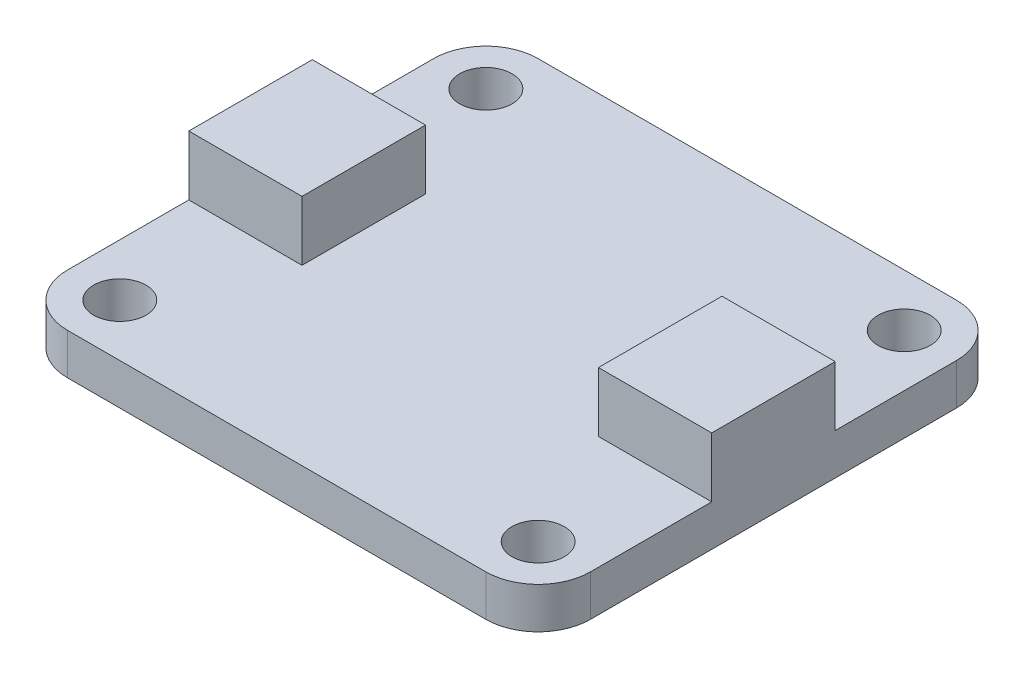
ISO-10303-21;
HEADER;
FILE_DESCRIPTION(('STEP AP214'),'2;1');
FILE_NAME('part.step','',(''),(''),'','','');
FILE_SCHEMA(('AUTOMOTIVE_DESIGN { 1 0 10303 214 1 1 1 1 }'));
ENDSEC;
DATA;
#1=APPLICATION_CONTEXT('core data for automotive mechanical design processes');
#2=APPLICATION_PROTOCOL_DEFINITION('international standard','automotive_design',2000,#1);
#3=PRODUCT_CONTEXT('',#1,'mechanical');
#4=PRODUCT('Part','Part','',(#3));
#5=PRODUCT_RELATED_PRODUCT_CATEGORY('part','',(#4));
#6=PRODUCT_DEFINITION_FORMATION('','',#4);
#7=PRODUCT_DEFINITION_CONTEXT('part definition',#1,'design');
#8=PRODUCT_DEFINITION('design','',#6,#7);
#9=PRODUCT_DEFINITION_SHAPE('','',#8);
#10=(LENGTH_UNIT() NAMED_UNIT(*) SI_UNIT(.MILLI.,.METRE.));
#11=(NAMED_UNIT(*) PLANE_ANGLE_UNIT() SI_UNIT($,.RADIAN.));
#12=(NAMED_UNIT(*) SI_UNIT($,.STERADIAN.) SOLID_ANGLE_UNIT());
#13=UNCERTAINTY_MEASURE_WITH_UNIT(LENGTH_MEASURE(1.E-05),#10,'distance_accuracy_value','');
#14=(GEOMETRIC_REPRESENTATION_CONTEXT(3) GLOBAL_UNCERTAINTY_ASSIGNED_CONTEXT((#13)) GLOBAL_UNIT_ASSIGNED_CONTEXT((#10,
#11,#12)) REPRESENTATION_CONTEXT('',''));
#15=CARTESIAN_POINT('',(0.,0.,0.));
#16=DIRECTION('',(0.,0.,1.));
#17=DIRECTION('',(1.,0.,0.));
#18=AXIS2_PLACEMENT_3D('',#15,#16,#17);
#19=CARTESIAN_POINT('',(0.,2.,0.));
#20=DIRECTION('',(0.,-1.,0.));
#21=DIRECTION('',(0.,0.,-1.));
#22=AXIS2_PLACEMENT_3D('',#19,#20,#21);
#23=PLANE('',#22);
#24=CARTESIAN_POINT('',(2.54,2.,-20.32));
#25=DIRECTION('',(0.,1.,0.));
#26=DIRECTION('',(0.,0.,-1.));
#27=AXIS2_PLACEMENT_3D('',#24,#25,#26);
#28=CIRCLE('',#27,1.27);
#29=CARTESIAN_POINT('',(2.54,2.,-21.59));
#30=VERTEX_POINT('',#29);
#31=EDGE_CURVE('E224',#30,#30,#28,.T.);
#32=ORIENTED_EDGE('',*,*,#31,.F.);
#33=EDGE_LOOP('',(#32));
#34=FACE_BOUND('',#33,.T.);
#35=CARTESIAN_POINT('',(22.86,2.,-20.32));
#36=DIRECTION('',(0.,1.,0.));
#37=DIRECTION('',(0.,0.,1.));
#38=AXIS2_PLACEMENT_3D('',#35,#36,#37);
#39=CIRCLE('',#38,1.27);
#40=CARTESIAN_POINT('',(22.86,2.,-19.05));
#41=VERTEX_POINT('',#40);
#42=EDGE_CURVE('E238',#41,#41,#39,.T.);
#43=ORIENTED_EDGE('',*,*,#42,.F.);
#44=EDGE_LOOP('',(#43));
#45=FACE_BOUND('',#44,.T.);
#46=CARTESIAN_POINT('',(22.86,2.,-2.54));
#47=DIRECTION('',(0.,1.,0.));
#48=DIRECTION('',(0.,0.,-1.));
#49=AXIS2_PLACEMENT_3D('',#46,#47,#48);
#50=CIRCLE('',#49,1.27);
#51=CARTESIAN_POINT('',(22.86,2.,-3.81));
#52=VERTEX_POINT('',#51);
#53=EDGE_CURVE('E230',#52,#52,#50,.T.);
#54=ORIENTED_EDGE('',*,*,#53,.F.);
#55=EDGE_LOOP('',(#54));
#56=FACE_BOUND('',#55,.T.);
#57=CARTESIAN_POINT('',(2.54,2.,-2.54));
#58=DIRECTION('',(0.,1.,0.));
#59=DIRECTION('',(0.,0.,1.));
#60=AXIS2_PLACEMENT_3D('',#57,#58,#59);
#61=CIRCLE('',#60,1.27);
#62=CARTESIAN_POINT('',(2.54,2.,-1.27));
#63=VERTEX_POINT('',#62);
#64=EDGE_CURVE('E229',#63,#63,#61,.T.);
#65=ORIENTED_EDGE('',*,*,#64,.F.);
#66=EDGE_LOOP('',(#65));
#67=FACE_BOUND('',#66,.T.);
#68=DIRECTION('',(-1.,0.,0.));
#69=VECTOR('',#68,1.);
#70=CARTESIAN_POINT('',(25.4,2.,-14.43));
#71=LINE('',#70,#69);
#72=CARTESIAN_POINT('',(25.4,2.,-14.43));
#73=VERTEX_POINT('',#72);
#74=CARTESIAN_POINT('',(19.9,2.,-14.43));
#75=VERTEX_POINT('',#74);
#76=EDGE_CURVE('E175',#73,#75,#71,.T.);
#77=ORIENTED_EDGE('',*,*,#76,.F.);
#78=DIRECTION('',(0.,0.,-1.));
#79=VECTOR('',#78,1.);
#80=CARTESIAN_POINT('',(25.4,2.,0.));
#81=LINE('',#80,#79);
#82=CARTESIAN_POINT('',(25.4,2.,-20.32));
#83=VERTEX_POINT('',#82);
#84=EDGE_CURVE('E265',#73,#83,#81,.T.);
#85=ORIENTED_EDGE('',*,*,#84,.T.);
#86=CARTESIAN_POINT('',(22.86,2.,-20.32));
#87=DIRECTION('',(0.,-1.,0.));
#88=DIRECTION('',(0.,0.,-1.));
#89=AXIS2_PLACEMENT_3D('',#86,#87,#88);
#90=CIRCLE('',#89,2.54);
#91=CARTESIAN_POINT('',(22.86,2.,-22.86));
#92=VERTEX_POINT('',#91);
#93=EDGE_CURVE('E324',#83,#92,#90,.F.);
#94=ORIENTED_EDGE('',*,*,#93,.T.);
#95=DIRECTION('',(-1.,0.,0.));
#96=VECTOR('',#95,1.);
#97=CARTESIAN_POINT('',(0.,2.,-22.86));
#98=LINE('',#97,#96);
#99=CARTESIAN_POINT('',(2.54,2.,-22.86));
#100=VERTEX_POINT('',#99);
#101=EDGE_CURVE('E269',#92,#100,#98,.T.);
#102=ORIENTED_EDGE('',*,*,#101,.T.);
#103=CARTESIAN_POINT('',(2.54,2.,-20.32));
#104=DIRECTION('',(0.,-1.,0.));
#105=DIRECTION('',(0.,0.,-1.));
#106=AXIS2_PLACEMENT_3D('',#103,#104,#105);
#107=CIRCLE('',#106,2.54);
#108=CARTESIAN_POINT('',(0.,2.,-20.32));
#109=VERTEX_POINT('',#108);
#110=EDGE_CURVE('E315',#100,#109,#107,.F.);
#111=ORIENTED_EDGE('',*,*,#110,.T.);
#112=DIRECTION('',(0.,0.,1.));
#113=VECTOR('',#112,1.);
#114=CARTESIAN_POINT('',(0.,2.,0.));
#115=LINE('',#114,#113);
#116=CARTESIAN_POINT('',(0.,2.,-14.43));
#117=VERTEX_POINT('',#116);
#118=EDGE_CURVE('E257',#109,#117,#115,.T.);
#119=ORIENTED_EDGE('',*,*,#118,.T.);
#120=DIRECTION('',(-1.,0.,0.));
#121=VECTOR('',#120,1.);
#122=CARTESIAN_POINT('',(0.,2.,-14.43));
#123=LINE('',#122,#121);
#124=CARTESIAN_POINT('',(5.5,2.,-14.43));
#125=VERTEX_POINT('',#124);
#126=EDGE_CURVE('E193',#125,#117,#123,.T.);
#127=ORIENTED_EDGE('',*,*,#126,.F.);
#128=DIRECTION('',(0.,0.,-1.));
#129=VECTOR('',#128,1.);
#130=CARTESIAN_POINT('',(5.5,2.,-14.43));
#131=LINE('',#130,#129);
#132=CARTESIAN_POINT('',(5.5,2.,-8.43));
#133=VERTEX_POINT('',#132);
#134=EDGE_CURVE('E182',#133,#125,#131,.T.);
#135=ORIENTED_EDGE('',*,*,#134,.F.);
#136=DIRECTION('',(1.,0.,0.));
#137=VECTOR('',#136,1.);
#138=CARTESIAN_POINT('',(0.,2.,-8.43));
#139=LINE('',#138,#137);
#140=CARTESIAN_POINT('',(0.,2.,-8.43));
#141=VERTEX_POINT('',#140);
#142=EDGE_CURVE('E177',#141,#133,#139,.T.);
#143=ORIENTED_EDGE('',*,*,#142,.F.);
#144=CARTESIAN_POINT('',(0.,2.,-2.54));
#145=VERTEX_POINT('',#144);
#146=EDGE_CURVE('E261',#141,#145,#115,.T.);
#147=ORIENTED_EDGE('',*,*,#146,.T.);
#148=CARTESIAN_POINT('',(2.54,2.,-2.54));
#149=DIRECTION('',(0.,-1.,0.));
#150=DIRECTION('',(0.,0.,-1.));
#151=AXIS2_PLACEMENT_3D('',#148,#149,#150);
#152=CIRCLE('',#151,2.54);
#153=CARTESIAN_POINT('',(2.54,2.,0.));
#154=VERTEX_POINT('',#153);
#155=EDGE_CURVE('E318',#145,#154,#152,.F.);
#156=ORIENTED_EDGE('',*,*,#155,.T.);
#157=DIRECTION('',(1.,0.,0.));
#158=VECTOR('',#157,1.);
#159=CARTESIAN_POINT('',(0.,2.,0.));
#160=LINE('',#159,#158);
#161=CARTESIAN_POINT('',(22.86,2.,0.));
#162=VERTEX_POINT('',#161);
#163=EDGE_CURVE('E260',#154,#162,#160,.T.);
#164=ORIENTED_EDGE('',*,*,#163,.T.);
#165=CARTESIAN_POINT('',(22.86,2.,-2.54));
#166=DIRECTION('',(0.,-1.,0.));
#167=DIRECTION('',(0.,0.,-1.));
#168=AXIS2_PLACEMENT_3D('',#165,#166,#167);
#169=CIRCLE('',#168,2.54);
#170=CARTESIAN_POINT('',(25.4,2.,-2.54));
#171=VERTEX_POINT('',#170);
#172=EDGE_CURVE('E321',#162,#171,#169,.F.);
#173=ORIENTED_EDGE('',*,*,#172,.T.);
#174=CARTESIAN_POINT('',(25.4,2.,-8.43));
#175=VERTEX_POINT('',#174);
#176=EDGE_CURVE('E266',#171,#175,#81,.T.);
#177=ORIENTED_EDGE('',*,*,#176,.T.);
#178=DIRECTION('',(1.,0.,0.));
#179=VECTOR('',#178,1.);
#180=CARTESIAN_POINT('',(25.4,2.,-8.43));
#181=LINE('',#180,#179);
#182=CARTESIAN_POINT('',(19.9,2.,-8.43));
#183=VERTEX_POINT('',#182);
#184=EDGE_CURVE('E60',#183,#175,#181,.T.);
#185=ORIENTED_EDGE('',*,*,#184,.F.);
#186=DIRECTION('',(0.,0.,1.));
#187=VECTOR('',#186,1.);
#188=CARTESIAN_POINT('',(19.9,2.,-14.43));
#189=LINE('',#188,#187);
#190=EDGE_CURVE('E55',#75,#183,#189,.T.);
#191=ORIENTED_EDGE('',*,*,#190,.F.);
#192=EDGE_LOOP('',(#77,#85,#94,#102,#111,#119,#127,#135,#143,#147,#156,#164,#173,#177,#185,#191));
#193=FACE_BOUND('',#192,.T.);
#194=ADVANCED_FACE('F39',(#34,#45,#56,#67,#193),#23,.F.);
#195=CARTESIAN_POINT('',(0.,2.,0.));
#196=DIRECTION('',(1.,0.,0.));
#197=DIRECTION('',(0.,0.,-1.));
#198=AXIS2_PLACEMENT_3D('',#195,#196,#197);
#199=PLANE('',#198);
#200=DIRECTION('',(0.,0.,1.));
#201=VECTOR('',#200,1.);
#202=CARTESIAN_POINT('',(0.,0.,0.));
#203=LINE('',#202,#201);
#204=CARTESIAN_POINT('',(0.,0.,-20.32));
#205=VERTEX_POINT('',#204);
#206=CARTESIAN_POINT('',(0.,0.,-2.54));
#207=VERTEX_POINT('',#206);
#208=EDGE_CURVE('E253',#205,#207,#203,.T.);
#209=ORIENTED_EDGE('',*,*,#208,.T.);
#210=DIRECTION('',(0.,-1.,0.));
#211=VECTOR('',#210,1.);
#212=CARTESIAN_POINT('',(0.,2.,-2.54));
#213=LINE('',#212,#211);
#214=EDGE_CURVE('E11',#207,#145,#213,.F.);
#215=ORIENTED_EDGE('',*,*,#214,.T.);
#216=ORIENTED_EDGE('',*,*,#146,.F.);
#217=DIRECTION('',(0.,-1.,0.));
#218=VECTOR('',#217,1.);
#219=CARTESIAN_POINT('',(0.,4.9,-8.43));
#220=LINE('',#219,#218);
#221=CARTESIAN_POINT('',(0.,4.9,-8.43));
#222=VERTEX_POINT('',#221);
#223=EDGE_CURVE('E220',#222,#141,#220,.T.);
#224=ORIENTED_EDGE('',*,*,#223,.F.);
#225=DIRECTION('',(0.,0.,1.));
#226=VECTOR('',#225,1.);
#227=CARTESIAN_POINT('',(0.,4.9,-14.43));
#228=LINE('',#227,#226);
#229=CARTESIAN_POINT('',(0.,4.9,-14.43));
#230=VERTEX_POINT('',#229);
#231=EDGE_CURVE('E188',#230,#222,#228,.T.);
#232=ORIENTED_EDGE('',*,*,#231,.F.);
#233=DIRECTION('',(0.,-1.,0.));
#234=VECTOR('',#233,1.);
#235=CARTESIAN_POINT('',(0.,4.9,-14.43));
#236=LINE('',#235,#234);
#237=EDGE_CURVE('E201',#230,#117,#236,.T.);
#238=ORIENTED_EDGE('',*,*,#237,.T.);
#239=ORIENTED_EDGE('',*,*,#118,.F.);
#240=DIRECTION('',(0.,-1.,0.));
#241=VECTOR('',#240,1.);
#242=CARTESIAN_POINT('',(0.,2.,-20.32));
#243=LINE('',#242,#241);
#244=EDGE_CURVE('E48',#109,#205,#243,.T.);
#245=ORIENTED_EDGE('',*,*,#244,.T.);
#246=EDGE_LOOP('',(#209,#215,#216,#224,#232,#238,#239,#245));
#247=FACE_BOUND('',#246,.T.);
#248=ADVANCED_FACE('F339',(#247),#199,.F.);
#249=CARTESIAN_POINT('',(0.,2.,0.));
#250=DIRECTION('',(0.,0.,-1.));
#251=DIRECTION('',(-1.,0.,0.));
#252=AXIS2_PLACEMENT_3D('',#249,#250,#251);
#253=PLANE('',#252);
#254=DIRECTION('',(1.,0.,0.));
#255=VECTOR('',#254,1.);
#256=CARTESIAN_POINT('',(0.,0.,0.));
#257=LINE('',#256,#255);
#258=CARTESIAN_POINT('',(2.54,0.,0.));
#259=VERTEX_POINT('',#258);
#260=CARTESIAN_POINT('',(22.86,0.,0.));
#261=VERTEX_POINT('',#260);
#262=EDGE_CURVE('E277',#259,#261,#257,.T.);
#263=ORIENTED_EDGE('',*,*,#262,.T.);
#264=DIRECTION('',(0.,-1.,0.));
#265=VECTOR('',#264,1.);
#266=CARTESIAN_POINT('',(22.86,2.,0.));
#267=LINE('',#266,#265);
#268=EDGE_CURVE('E331',#261,#162,#267,.F.);
#269=ORIENTED_EDGE('',*,*,#268,.T.);
#270=ORIENTED_EDGE('',*,*,#163,.F.);
#271=DIRECTION('',(0.,-1.,0.));
#272=VECTOR('',#271,1.);
#273=CARTESIAN_POINT('',(2.54,2.,0.));
#274=LINE('',#273,#272);
#275=EDGE_CURVE('E327',#154,#259,#274,.T.);
#276=ORIENTED_EDGE('',*,*,#275,.T.);
#277=EDGE_LOOP('',(#263,#269,#270,#276));
#278=FACE_BOUND('',#277,.T.);
#279=ADVANCED_FACE('F353',(#278),#253,.F.);
#280=CARTESIAN_POINT('',(25.4,2.,0.));
#281=DIRECTION('',(-1.,0.,0.));
#282=DIRECTION('',(0.,0.,1.));
#283=AXIS2_PLACEMENT_3D('',#280,#281,#282);
#284=PLANE('',#283);
#285=DIRECTION('',(0.,0.,-1.));
#286=VECTOR('',#285,1.);
#287=CARTESIAN_POINT('',(25.4,0.,0.));
#288=LINE('',#287,#286);
#289=CARTESIAN_POINT('',(25.4,0.,-2.54));
#290=VERTEX_POINT('',#289);
#291=CARTESIAN_POINT('',(25.4,0.,-20.32));
#292=VERTEX_POINT('',#291);
#293=EDGE_CURVE('E281',#290,#292,#288,.T.);
#294=ORIENTED_EDGE('',*,*,#293,.T.);
#295=DIRECTION('',(0.,-1.,0.));
#296=VECTOR('',#295,1.);
#297=CARTESIAN_POINT('',(25.4,2.,-20.32));
#298=LINE('',#297,#296);
#299=EDGE_CURVE('E311',#292,#83,#298,.F.);
#300=ORIENTED_EDGE('',*,*,#299,.T.);
#301=ORIENTED_EDGE('',*,*,#84,.F.);
#302=DIRECTION('',(0.,-1.,0.));
#303=VECTOR('',#302,1.);
#304=CARTESIAN_POINT('',(25.4,4.9,-14.43));
#305=LINE('',#304,#303);
#306=CARTESIAN_POINT('',(25.4,4.9,-14.43));
#307=VERTEX_POINT('',#306);
#308=EDGE_CURVE('E595',#307,#73,#305,.T.);
#309=ORIENTED_EDGE('',*,*,#308,.F.);
#310=DIRECTION('',(0.,0.,-1.));
#311=VECTOR('',#310,1.);
#312=CARTESIAN_POINT('',(25.4,4.9,-14.43));
#313=LINE('',#312,#311);
#314=CARTESIAN_POINT('',(25.4,4.9,-8.43));
#315=VERTEX_POINT('',#314);
#316=EDGE_CURVE('E168',#315,#307,#313,.T.);
#317=ORIENTED_EDGE('',*,*,#316,.F.);
#318=DIRECTION('',(0.,-1.,0.));
#319=VECTOR('',#318,1.);
#320=CARTESIAN_POINT('',(25.4,4.9,-8.43));
#321=LINE('',#320,#319);
#322=EDGE_CURVE('E184',#315,#175,#321,.T.);
#323=ORIENTED_EDGE('',*,*,#322,.T.);
#324=ORIENTED_EDGE('',*,*,#176,.F.);
#325=DIRECTION('',(0.,-1.,0.));
#326=VECTOR('',#325,1.);
#327=CARTESIAN_POINT('',(25.4,2.,-2.54));
#328=LINE('',#327,#326);
#329=EDGE_CURVE('E307',#171,#290,#328,.T.);
#330=ORIENTED_EDGE('',*,*,#329,.T.);
#331=EDGE_LOOP('',(#294,#300,#301,#309,#317,#323,#324,#330));
#332=FACE_BOUND('',#331,.T.);
#333=ADVANCED_FACE('F362',(#332),#284,.F.);
#334=CARTESIAN_POINT('',(0.,2.,-22.86));
#335=DIRECTION('',(0.,0.,1.));
#336=DIRECTION('',(1.,0.,0.));
#337=AXIS2_PLACEMENT_3D('',#334,#335,#336);
#338=PLANE('',#337);
#339=ORIENTED_EDGE('',*,*,#101,.F.);
#340=DIRECTION('',(0.,-1.,0.));
#341=VECTOR('',#340,1.);
#342=CARTESIAN_POINT('',(22.86,2.,-22.86));
#343=LINE('',#342,#341);
#344=CARTESIAN_POINT('',(22.86,0.,-22.86));
#345=VERTEX_POINT('',#344);
#346=EDGE_CURVE('E291',#92,#345,#343,.T.);
#347=ORIENTED_EDGE('',*,*,#346,.T.);
#348=DIRECTION('',(-1.,0.,0.));
#349=VECTOR('',#348,1.);
#350=CARTESIAN_POINT('',(0.,0.,-22.86));
#351=LINE('',#350,#349);
#352=CARTESIAN_POINT('',(2.54,0.,-22.86));
#353=VERTEX_POINT('',#352);
#354=EDGE_CURVE('E285',#345,#353,#351,.T.);
#355=ORIENTED_EDGE('',*,*,#354,.T.);
#356=DIRECTION('',(0.,-1.,0.));
#357=VECTOR('',#356,1.);
#358=CARTESIAN_POINT('',(2.54,2.,-22.86));
#359=LINE('',#358,#357);
#360=EDGE_CURVE('E273',#353,#100,#359,.F.);
#361=ORIENTED_EDGE('',*,*,#360,.T.);
#362=EDGE_LOOP('',(#339,#347,#355,#361));
#363=FACE_BOUND('',#362,.T.);
#364=ADVANCED_FACE('F371',(#363),#338,.F.);
#365=CARTESIAN_POINT('',(0.,0.,0.));
#366=DIRECTION('',(0.,-1.,0.));
#367=DIRECTION('',(0.,0.,-1.));
#368=AXIS2_PLACEMENT_3D('',#365,#366,#367);
#369=PLANE('',#368);
#370=CARTESIAN_POINT('',(2.54,0.,-20.32));
#371=DIRECTION('',(0.,1.,0.));
#372=DIRECTION('',(0.,0.,-1.));
#373=AXIS2_PLACEMENT_3D('',#370,#371,#372);
#374=CIRCLE('',#373,1.27);
#375=CARTESIAN_POINT('',(2.54,0.,-21.59));
#376=VERTEX_POINT('',#375);
#377=EDGE_CURVE('E242',#376,#376,#374,.T.);
#378=ORIENTED_EDGE('',*,*,#377,.T.);
#379=EDGE_LOOP('',(#378));
#380=FACE_BOUND('',#379,.T.);
#381=CARTESIAN_POINT('',(22.86,0.,-20.32));
#382=DIRECTION('',(0.,1.,0.));
#383=DIRECTION('',(0.,0.,1.));
#384=AXIS2_PLACEMENT_3D('',#381,#382,#383);
#385=CIRCLE('',#384,1.27);
#386=CARTESIAN_POINT('',(22.86,0.,-19.05));
#387=VERTEX_POINT('',#386);
#388=EDGE_CURVE('E234',#387,#387,#385,.T.);
#389=ORIENTED_EDGE('',*,*,#388,.T.);
#390=EDGE_LOOP('',(#389));
#391=FACE_BOUND('',#390,.T.);
#392=CARTESIAN_POINT('',(22.86,0.,-2.54));
#393=DIRECTION('',(0.,1.,0.));
#394=DIRECTION('',(0.,0.,-1.));
#395=AXIS2_PLACEMENT_3D('',#392,#393,#394);
#396=CIRCLE('',#395,1.27);
#397=CARTESIAN_POINT('',(22.86,0.,-3.81));
#398=VERTEX_POINT('',#397);
#399=EDGE_CURVE('E225',#398,#398,#396,.T.);
#400=ORIENTED_EDGE('',*,*,#399,.T.);
#401=EDGE_LOOP('',(#400));
#402=FACE_BOUND('',#401,.T.);
#403=CARTESIAN_POINT('',(2.54,0.,-2.54));
#404=DIRECTION('',(0.,1.,0.));
#405=DIRECTION('',(0.,0.,1.));
#406=AXIS2_PLACEMENT_3D('',#403,#404,#405);
#407=CIRCLE('',#406,1.27);
#408=CARTESIAN_POINT('',(2.54,0.,-1.27));
#409=VERTEX_POINT('',#408);
#410=EDGE_CURVE('E249',#409,#409,#407,.T.);
#411=ORIENTED_EDGE('',*,*,#410,.T.);
#412=EDGE_LOOP('',(#411));
#413=FACE_BOUND('',#412,.T.);
#414=ORIENTED_EDGE('',*,*,#354,.F.);
#415=CARTESIAN_POINT('',(22.86,0.,-20.32));
#416=DIRECTION('',(0.,-1.,0.));
#417=DIRECTION('',(0.,0.,-1.));
#418=AXIS2_PLACEMENT_3D('',#415,#416,#417);
#419=CIRCLE('',#418,2.54);
#420=EDGE_CURVE('E304',#345,#292,#419,.T.);
#421=ORIENTED_EDGE('',*,*,#420,.T.);
#422=ORIENTED_EDGE('',*,*,#293,.F.);
#423=CARTESIAN_POINT('',(22.86,0.,-2.54));
#424=DIRECTION('',(0.,-1.,0.));
#425=DIRECTION('',(0.,0.,-1.));
#426=AXIS2_PLACEMENT_3D('',#423,#424,#425);
#427=CIRCLE('',#426,2.54);
#428=EDGE_CURVE('E301',#290,#261,#427,.T.);
#429=ORIENTED_EDGE('',*,*,#428,.T.);
#430=ORIENTED_EDGE('',*,*,#262,.F.);
#431=CARTESIAN_POINT('',(2.54,0.,-2.54));
#432=DIRECTION('',(0.,-1.,0.));
#433=DIRECTION('',(0.,0.,-1.));
#434=AXIS2_PLACEMENT_3D('',#431,#432,#433);
#435=CIRCLE('',#434,2.54);
#436=EDGE_CURVE('E298',#259,#207,#435,.T.);
#437=ORIENTED_EDGE('',*,*,#436,.T.);
#438=ORIENTED_EDGE('',*,*,#208,.F.);
#439=CARTESIAN_POINT('',(2.54,0.,-20.32));
#440=DIRECTION('',(0.,-1.,0.));
#441=DIRECTION('',(0.,0.,-1.));
#442=AXIS2_PLACEMENT_3D('',#439,#440,#441);
#443=CIRCLE('',#442,2.54);
#444=EDGE_CURVE('E295',#205,#353,#443,.T.);
#445=ORIENTED_EDGE('',*,*,#444,.T.);
#446=EDGE_LOOP('',(#414,#421,#422,#429,#430,#437,#438,#445));
#447=FACE_BOUND('',#446,.T.);
#448=ADVANCED_FACE('F345',(#380,#391,#402,#413,#447),#369,.T.);
#449=CARTESIAN_POINT('',(2.54,0.,-2.54));
#450=DIRECTION('',(0.,1.,0.));
#451=DIRECTION('',(0.,0.,1.));
#452=AXIS2_PLACEMENT_3D('',#449,#450,#451);
#453=CYLINDRICAL_SURFACE('',#452,1.27);
#454=ORIENTED_EDGE('',*,*,#410,.F.);
#455=EDGE_LOOP('',(#454));
#456=FACE_BOUND('',#455,.T.);
#457=ORIENTED_EDGE('',*,*,#64,.T.);
#458=EDGE_LOOP('',(#457));
#459=FACE_BOUND('',#458,.T.);
#460=ADVANCED_FACE('F393',(#456,#459),#453,.F.);
#461=CARTESIAN_POINT('',(22.86,0.,-2.54));
#462=DIRECTION('',(0.,1.,0.));
#463=DIRECTION('',(0.,0.,1.));
#464=AXIS2_PLACEMENT_3D('',#461,#462,#463);
#465=CYLINDRICAL_SURFACE('',#464,1.27);
#466=ORIENTED_EDGE('',*,*,#399,.F.);
#467=EDGE_LOOP('',(#466));
#468=FACE_BOUND('',#467,.T.);
#469=ORIENTED_EDGE('',*,*,#53,.T.);
#470=EDGE_LOOP('',(#469));
#471=FACE_BOUND('',#470,.T.);
#472=ADVANCED_FACE('F513',(#468,#471),#465,.F.);
#473=CARTESIAN_POINT('',(22.86,0.,-20.32));
#474=DIRECTION('',(0.,1.,0.));
#475=DIRECTION('',(0.,0.,1.));
#476=AXIS2_PLACEMENT_3D('',#473,#474,#475);
#477=CYLINDRICAL_SURFACE('',#476,1.27);
#478=ORIENTED_EDGE('',*,*,#388,.F.);
#479=EDGE_LOOP('',(#478));
#480=FACE_BOUND('',#479,.T.);
#481=ORIENTED_EDGE('',*,*,#42,.T.);
#482=EDGE_LOOP('',(#481));
#483=FACE_BOUND('',#482,.T.);
#484=ADVANCED_FACE('F516',(#480,#483),#477,.F.);
#485=CARTESIAN_POINT('',(2.54,0.,-20.32));
#486=DIRECTION('',(0.,1.,0.));
#487=DIRECTION('',(0.,0.,1.));
#488=AXIS2_PLACEMENT_3D('',#485,#486,#487);
#489=CYLINDRICAL_SURFACE('',#488,1.27);
#490=ORIENTED_EDGE('',*,*,#377,.F.);
#491=EDGE_LOOP('',(#490));
#492=FACE_BOUND('',#491,.T.);
#493=ORIENTED_EDGE('',*,*,#31,.T.);
#494=EDGE_LOOP('',(#493));
#495=FACE_BOUND('',#494,.T.);
#496=ADVANCED_FACE('F406',(#492,#495),#489,.F.);
#497=CARTESIAN_POINT('',(22.86,2.,-20.32));
#498=DIRECTION('',(0.,-1.,0.));
#499=DIRECTION('',(0.,0.,-1.));
#500=AXIS2_PLACEMENT_3D('',#497,#498,#499);
#501=CYLINDRICAL_SURFACE('',#500,2.54);
#502=ORIENTED_EDGE('',*,*,#93,.F.);
#503=ORIENTED_EDGE('',*,*,#299,.F.);
#504=ORIENTED_EDGE('',*,*,#420,.F.);
#505=ORIENTED_EDGE('',*,*,#346,.F.);
#506=EDGE_LOOP('',(#502,#503,#504,#505));
#507=FACE_BOUND('',#506,.T.);
#508=ADVANCED_FACE('F368',(#507),#501,.T.);
#509=CARTESIAN_POINT('',(22.86,2.,-2.54));
#510=DIRECTION('',(0.,-1.,0.));
#511=DIRECTION('',(0.,0.,-1.));
#512=AXIS2_PLACEMENT_3D('',#509,#510,#511);
#513=CYLINDRICAL_SURFACE('',#512,2.54);
#514=ORIENTED_EDGE('',*,*,#172,.F.);
#515=ORIENTED_EDGE('',*,*,#268,.F.);
#516=ORIENTED_EDGE('',*,*,#428,.F.);
#517=ORIENTED_EDGE('',*,*,#329,.F.);
#518=EDGE_LOOP('',(#514,#515,#516,#517));
#519=FACE_BOUND('',#518,.T.);
#520=ADVANCED_FACE('F359',(#519),#513,.T.);
#521=CARTESIAN_POINT('',(2.54,2.,-2.54));
#522=DIRECTION('',(0.,-1.,0.));
#523=DIRECTION('',(0.,0.,-1.));
#524=AXIS2_PLACEMENT_3D('',#521,#522,#523);
#525=CYLINDRICAL_SURFACE('',#524,2.54);
#526=ORIENTED_EDGE('',*,*,#155,.F.);
#527=ORIENTED_EDGE('',*,*,#214,.F.);
#528=ORIENTED_EDGE('',*,*,#436,.F.);
#529=ORIENTED_EDGE('',*,*,#275,.F.);
#530=EDGE_LOOP('',(#526,#527,#528,#529));
#531=FACE_BOUND('',#530,.T.);
#532=ADVANCED_FACE('F350',(#531),#525,.T.);
#533=CARTESIAN_POINT('',(2.54,2.,-20.32));
#534=DIRECTION('',(0.,-1.,0.));
#535=DIRECTION('',(0.,0.,-1.));
#536=AXIS2_PLACEMENT_3D('',#533,#534,#535);
#537=CYLINDRICAL_SURFACE('',#536,2.54);
#538=ORIENTED_EDGE('',*,*,#110,.F.);
#539=ORIENTED_EDGE('',*,*,#360,.F.);
#540=ORIENTED_EDGE('',*,*,#444,.F.);
#541=ORIENTED_EDGE('',*,*,#244,.F.);
#542=EDGE_LOOP('',(#538,#539,#540,#541));
#543=FACE_BOUND('',#542,.T.);
#544=ADVANCED_FACE('F41',(#543),#537,.T.);
#545=CARTESIAN_POINT('',(0.,4.9,-8.43));
#546=DIRECTION('',(0.,0.,-1.));
#547=DIRECTION('',(-1.,0.,0.));
#548=AXIS2_PLACEMENT_3D('',#545,#546,#547);
#549=PLANE('',#548);
#550=ORIENTED_EDGE('',*,*,#142,.T.);
#551=DIRECTION('',(0.,-1.,0.));
#552=VECTOR('',#551,1.);
#553=CARTESIAN_POINT('',(5.5,4.9,-8.43));
#554=LINE('',#553,#552);
#555=CARTESIAN_POINT('',(5.5,4.9,-8.43));
#556=VERTEX_POINT('',#555);
#557=EDGE_CURVE('E216',#556,#133,#554,.T.);
#558=ORIENTED_EDGE('',*,*,#557,.F.);
#559=DIRECTION('',(1.,0.,0.));
#560=VECTOR('',#559,1.);
#561=CARTESIAN_POINT('',(0.,4.9,-8.43));
#562=LINE('',#561,#560);
#563=EDGE_CURVE('E192',#222,#556,#562,.T.);
#564=ORIENTED_EDGE('',*,*,#563,.F.);
#565=ORIENTED_EDGE('',*,*,#223,.T.);
#566=EDGE_LOOP('',(#550,#558,#564,#565));
#567=FACE_BOUND('',#566,.T.);
#568=ADVANCED_FACE('F374',(#567),#549,.F.);
#569=CARTESIAN_POINT('',(5.5,4.9,-14.43));
#570=DIRECTION('',(-1.,0.,0.));
#571=DIRECTION('',(0.,0.,1.));
#572=AXIS2_PLACEMENT_3D('',#569,#570,#571);
#573=PLANE('',#572);
#574=ORIENTED_EDGE('',*,*,#134,.T.);
#575=DIRECTION('',(0.,-1.,0.));
#576=VECTOR('',#575,1.);
#577=CARTESIAN_POINT('',(5.5,4.9,-14.43));
#578=LINE('',#577,#576);
#579=CARTESIAN_POINT('',(5.5,4.9,-14.43));
#580=VERTEX_POINT('',#579);
#581=EDGE_CURVE('E212',#580,#125,#578,.T.);
#582=ORIENTED_EDGE('',*,*,#581,.F.);
#583=DIRECTION('',(0.,0.,-1.));
#584=VECTOR('',#583,1.);
#585=CARTESIAN_POINT('',(5.5,4.9,-14.43));
#586=LINE('',#585,#584);
#587=EDGE_CURVE('E196',#556,#580,#586,.T.);
#588=ORIENTED_EDGE('',*,*,#587,.F.);
#589=ORIENTED_EDGE('',*,*,#557,.T.);
#590=EDGE_LOOP('',(#574,#582,#588,#589));
#591=FACE_BOUND('',#590,.T.);
#592=ADVANCED_FACE('F379',(#591),#573,.F.);
#593=CARTESIAN_POINT('',(0.,4.9,-14.43));
#594=DIRECTION('',(0.,0.,1.));
#595=DIRECTION('',(1.,0.,0.));
#596=AXIS2_PLACEMENT_3D('',#593,#594,#595);
#597=PLANE('',#596);
#598=ORIENTED_EDGE('',*,*,#126,.T.);
#599=ORIENTED_EDGE('',*,*,#237,.F.);
#600=DIRECTION('',(-1.,0.,0.));
#601=VECTOR('',#600,1.);
#602=CARTESIAN_POINT('',(0.,4.9,-14.43));
#603=LINE('',#602,#601);
#604=EDGE_CURVE('E199',#580,#230,#603,.T.);
#605=ORIENTED_EDGE('',*,*,#604,.F.);
#606=ORIENTED_EDGE('',*,*,#581,.T.);
#607=EDGE_LOOP('',(#598,#599,#605,#606));
#608=FACE_BOUND('',#607,.T.);
#609=ADVANCED_FACE('F454',(#608),#597,.F.);
#610=CARTESIAN_POINT('',(0.,4.9,0.));
#611=DIRECTION('',(0.,1.,0.));
#612=DIRECTION('',(0.,0.,1.));
#613=AXIS2_PLACEMENT_3D('',#610,#611,#612);
#614=PLANE('',#613);
#615=ORIENTED_EDGE('',*,*,#231,.T.);
#616=ORIENTED_EDGE('',*,*,#563,.T.);
#617=ORIENTED_EDGE('',*,*,#587,.T.);
#618=ORIENTED_EDGE('',*,*,#604,.T.);
#619=EDGE_LOOP('',(#615,#616,#617,#618));
#620=FACE_BOUND('',#619,.T.);
#621=ADVANCED_FACE('F464',(#620),#614,.T.);
#622=CARTESIAN_POINT('',(25.4,4.9,-14.43));
#623=DIRECTION('',(0.,0.,1.));
#624=DIRECTION('',(1.,0.,0.));
#625=AXIS2_PLACEMENT_3D('',#622,#623,#624);
#626=PLANE('',#625);
#627=ORIENTED_EDGE('',*,*,#76,.T.);
#628=DIRECTION('',(0.,-1.,0.));
#629=VECTOR('',#628,1.);
#630=CARTESIAN_POINT('',(19.9,4.9,-14.43));
#631=LINE('',#630,#629);
#632=CARTESIAN_POINT('',(19.9,4.9,-14.43));
#633=VERTEX_POINT('',#632);
#634=EDGE_CURVE('E155',#633,#75,#631,.T.);
#635=ORIENTED_EDGE('',*,*,#634,.F.);
#636=DIRECTION('',(-1.,0.,0.));
#637=VECTOR('',#636,1.);
#638=CARTESIAN_POINT('',(25.4,4.9,-14.43));
#639=LINE('',#638,#637);
#640=EDGE_CURVE('E163',#307,#633,#639,.T.);
#641=ORIENTED_EDGE('',*,*,#640,.F.);
#642=ORIENTED_EDGE('',*,*,#308,.T.);
#643=EDGE_LOOP('',(#627,#635,#641,#642));
#644=FACE_BOUND('',#643,.T.);
#645=ADVANCED_FACE('F174',(#644),#626,.F.);
#646=CARTESIAN_POINT('',(19.9,4.9,-14.43));
#647=DIRECTION('',(1.,0.,0.));
#648=DIRECTION('',(0.,0.,-1.));
#649=AXIS2_PLACEMENT_3D('',#646,#647,#648);
#650=PLANE('',#649);
#651=ORIENTED_EDGE('',*,*,#190,.T.);
#652=DIRECTION('',(0.,-1.,0.));
#653=VECTOR('',#652,1.);
#654=CARTESIAN_POINT('',(19.9,4.9,-8.43));
#655=LINE('',#654,#653);
#656=CARTESIAN_POINT('',(19.9,4.9,-8.43));
#657=VERTEX_POINT('',#656);
#658=EDGE_CURVE('E158',#657,#183,#655,.T.);
#659=ORIENTED_EDGE('',*,*,#658,.F.);
#660=DIRECTION('',(0.,0.,1.));
#661=VECTOR('',#660,1.);
#662=CARTESIAN_POINT('',(19.9,4.9,-14.43));
#663=LINE('',#662,#661);
#664=EDGE_CURVE('E151',#633,#657,#663,.T.);
#665=ORIENTED_EDGE('',*,*,#664,.F.);
#666=ORIENTED_EDGE('',*,*,#634,.T.);
#667=EDGE_LOOP('',(#651,#659,#665,#666));
#668=FACE_BOUND('',#667,.T.);
#669=ADVANCED_FACE('F153',(#668),#650,.F.);
#670=CARTESIAN_POINT('',(25.4,4.9,-8.43));
#671=DIRECTION('',(0.,0.,-1.));
#672=DIRECTION('',(-1.,0.,0.));
#673=AXIS2_PLACEMENT_3D('',#670,#671,#672);
#674=PLANE('',#673);
#675=ORIENTED_EDGE('',*,*,#184,.T.);
#676=ORIENTED_EDGE('',*,*,#322,.F.);
#677=DIRECTION('',(1.,0.,0.));
#678=VECTOR('',#677,1.);
#679=CARTESIAN_POINT('',(25.4,4.9,-8.43));
#680=LINE('',#679,#678);
#681=EDGE_CURVE('E162',#657,#315,#680,.T.);
#682=ORIENTED_EDGE('',*,*,#681,.F.);
#683=ORIENTED_EDGE('',*,*,#658,.T.);
#684=EDGE_LOOP('',(#675,#676,#682,#683));
#685=FACE_BOUND('',#684,.T.);
#686=ADVANCED_FACE('F491',(#685),#674,.F.);
#687=CARTESIAN_POINT('',(0.,4.9,0.));
#688=DIRECTION('',(0.,1.,0.));
#689=DIRECTION('',(0.,0.,1.));
#690=AXIS2_PLACEMENT_3D('',#687,#688,#689);
#691=PLANE('',#690);
#692=ORIENTED_EDGE('',*,*,#640,.T.);
#693=ORIENTED_EDGE('',*,*,#664,.T.);
#694=ORIENTED_EDGE('',*,*,#681,.T.);
#695=ORIENTED_EDGE('',*,*,#316,.T.);
#696=EDGE_LOOP('',(#692,#693,#694,#695));
#697=FACE_BOUND('',#696,.T.);
#698=ADVANCED_FACE('F166',(#697),#691,.T.);
#699=CLOSED_SHELL('',(#194,#248,#279,#333,#364,#448,#460,#472,#484,#496,#508,#520,#532,#544,
#568,#592,#609,#621,#645,#669,#686,#698));
#700=MANIFOLD_SOLID_BREP('B2',#699);
#701=ADVANCED_BREP_SHAPE_REPRESENTATION('',(#18,#700),#14);
#702=SHAPE_DEFINITION_REPRESENTATION(#9,#701);
ENDSEC;
END-ISO-10303-21;
